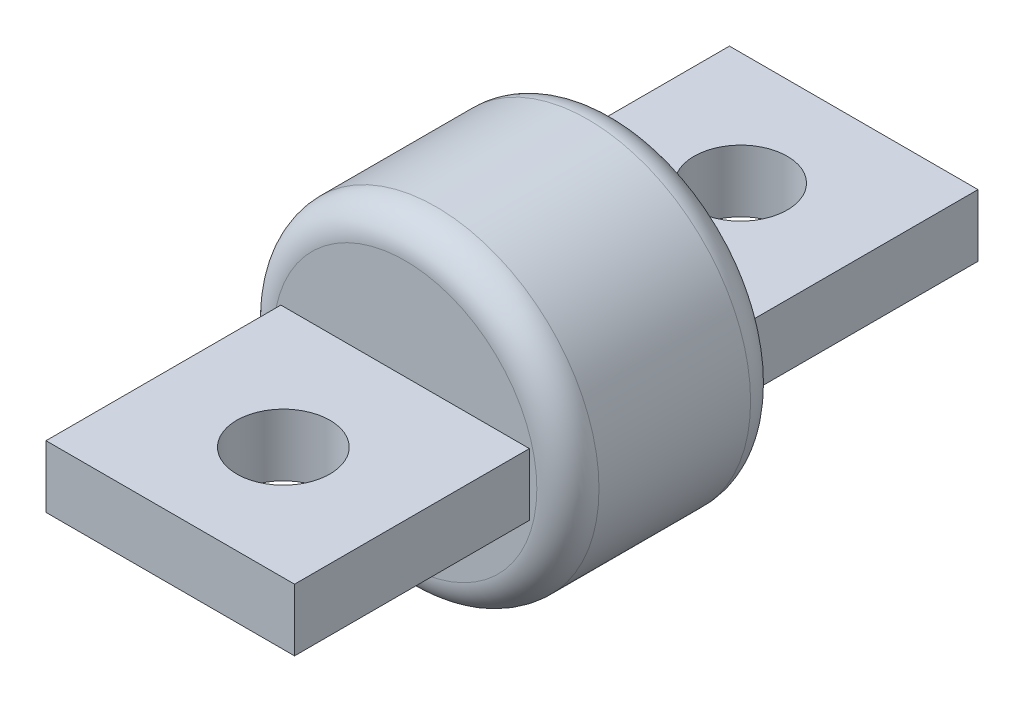
ISO-10303-21;
HEADER;
FILE_DESCRIPTION(('STEP AP214'),'2;1');
FILE_NAME('part.step','',(''),(''),'','','');
FILE_SCHEMA(('AUTOMOTIVE_DESIGN { 1 0 10303 214 1 1 1 1 }'));
ENDSEC;
DATA;
#1=APPLICATION_CONTEXT('core data for automotive mechanical design processes');
#2=APPLICATION_PROTOCOL_DEFINITION('international standard','automotive_design',2000,#1);
#3=PRODUCT_CONTEXT('',#1,'mechanical');
#4=PRODUCT('Part','Part','',(#3));
#5=PRODUCT_RELATED_PRODUCT_CATEGORY('part','',(#4));
#6=PRODUCT_DEFINITION_FORMATION('','',#4);
#7=PRODUCT_DEFINITION_CONTEXT('part definition',#1,'design');
#8=PRODUCT_DEFINITION('design','',#6,#7);
#9=PRODUCT_DEFINITION_SHAPE('','',#8);
#10=(LENGTH_UNIT() NAMED_UNIT(*) SI_UNIT(.MILLI.,.METRE.));
#11=(NAMED_UNIT(*) PLANE_ANGLE_UNIT() SI_UNIT($,.RADIAN.));
#12=(NAMED_UNIT(*) SI_UNIT($,.STERADIAN.) SOLID_ANGLE_UNIT());
#13=UNCERTAINTY_MEASURE_WITH_UNIT(LENGTH_MEASURE(1.E-05),#10,'distance_accuracy_value','');
#14=(GEOMETRIC_REPRESENTATION_CONTEXT(3) GLOBAL_UNCERTAINTY_ASSIGNED_CONTEXT((#13)) GLOBAL_UNIT_ASSIGNED_CONTEXT((#10,
#11,#12)) REPRESENTATION_CONTEXT('',''));
#15=CARTESIAN_POINT('',(0.,0.,0.));
#16=DIRECTION('',(0.,0.,1.));
#17=DIRECTION('',(1.,0.,0.));
#18=AXIS2_PLACEMENT_3D('',#15,#16,#17);
#19=CARTESIAN_POINT('',(0.,0.,0.));
#20=DIRECTION('',(0.,0.,1.));
#21=DIRECTION('',(1.,0.,0.));
#22=AXIS2_PLACEMENT_3D('',#19,#20,#21);
#23=PLANE('',#22);
#24=CARTESIAN_POINT('',(0.,0.,0.));
#25=DIRECTION('',(0.,0.,1.));
#26=DIRECTION('',(1.,0.,0.));
#27=AXIS2_PLACEMENT_3D('',#24,#25,#26);
#28=CIRCLE('',#27,13.462);
#29=CARTESIAN_POINT('',(13.462,0.,0.));
#30=VERTEX_POINT('',#29);
#31=EDGE_CURVE('E56',#30,#30,#28,.F.);
#32=ORIENTED_EDGE('',*,*,#31,.T.);
#33=EDGE_LOOP('',(#32));
#34=FACE_BOUND('',#33,.T.);
#35=DIRECTION('',(0.,-1.,0.));
#36=VECTOR('',#35,1.);
#37=CARTESIAN_POINT('',(12.7,-3.175,0.));
#38=LINE('',#37,#36);
#39=CARTESIAN_POINT('',(12.7,3.175,0.));
#40=VERTEX_POINT('',#39);
#41=CARTESIAN_POINT('',(12.7,-3.175,0.));
#42=VERTEX_POINT('',#41);
#43=EDGE_CURVE('E133',#40,#42,#38,.T.);
#44=ORIENTED_EDGE('',*,*,#43,.F.);
#45=DIRECTION('',(1.,0.,0.));
#46=VECTOR('',#45,1.);
#47=CARTESIAN_POINT('',(-12.7,3.175,0.));
#48=LINE('',#47,#46);
#49=CARTESIAN_POINT('',(-12.7,3.175,0.));
#50=VERTEX_POINT('',#49);
#51=EDGE_CURVE('E130',#50,#40,#48,.T.);
#52=ORIENTED_EDGE('',*,*,#51,.F.);
#53=DIRECTION('',(0.,1.,0.));
#54=VECTOR('',#53,1.);
#55=CARTESIAN_POINT('',(-12.7,-3.175,0.));
#56=LINE('',#55,#54);
#57=CARTESIAN_POINT('',(-12.7,-3.175,0.));
#58=VERTEX_POINT('',#57);
#59=EDGE_CURVE('E68',#58,#50,#56,.T.);
#60=ORIENTED_EDGE('',*,*,#59,.F.);
#61=DIRECTION('',(-1.,0.,0.));
#62=VECTOR('',#61,1.);
#63=CARTESIAN_POINT('',(-12.7,-3.175,0.));
#64=LINE('',#63,#62);
#65=EDGE_CURVE('E63',#42,#58,#64,.T.);
#66=ORIENTED_EDGE('',*,*,#65,.F.);
#67=EDGE_LOOP('',(#44,#52,#60,#66));
#68=FACE_BOUND('',#67,.T.);
#69=ADVANCED_FACE('F48',(#34,#68),#23,.F.);
#70=CARTESIAN_POINT('',(0.,0.,21.844));
#71=DIRECTION('',(0.,0.,1.));
#72=DIRECTION('',(1.,0.,0.));
#73=AXIS2_PLACEMENT_3D('',#70,#71,#72);
#74=PLANE('',#73);
#75=CARTESIAN_POINT('',(0.,0.,21.844));
#76=DIRECTION('',(0.,0.,1.));
#77=DIRECTION('',(1.,0.,0.));
#78=AXIS2_PLACEMENT_3D('',#75,#76,#77);
#79=CIRCLE('',#78,13.462);
#80=CARTESIAN_POINT('',(13.462,0.,21.844));
#81=VERTEX_POINT('',#80);
#82=EDGE_CURVE('E13',#81,#81,#79,.T.);
#83=ORIENTED_EDGE('',*,*,#82,.T.);
#84=EDGE_LOOP('',(#83));
#85=FACE_BOUND('',#84,.T.);
#86=DIRECTION('',(-1.,0.,0.));
#87=VECTOR('',#86,1.);
#88=CARTESIAN_POINT('',(-12.7,3.175,21.844));
#89=LINE('',#88,#87);
#90=CARTESIAN_POINT('',(12.7,3.175,21.844));
#91=VERTEX_POINT('',#90);
#92=CARTESIAN_POINT('',(-12.7,3.175,21.844));
#93=VERTEX_POINT('',#92);
#94=EDGE_CURVE('E137',#91,#93,#89,.T.);
#95=ORIENTED_EDGE('',*,*,#94,.F.);
#96=DIRECTION('',(0.,1.,0.));
#97=VECTOR('',#96,1.);
#98=CARTESIAN_POINT('',(12.7,-3.175,21.844));
#99=LINE('',#98,#97);
#100=CARTESIAN_POINT('',(12.7,-3.175,21.844));
#101=VERTEX_POINT('',#100);
#102=EDGE_CURVE('E134',#101,#91,#99,.T.);
#103=ORIENTED_EDGE('',*,*,#102,.F.);
#104=DIRECTION('',(1.,0.,0.));
#105=VECTOR('',#104,1.);
#106=CARTESIAN_POINT('',(-12.7,-3.175,21.844));
#107=LINE('',#106,#105);
#108=CARTESIAN_POINT('',(-12.7,-3.175,21.844));
#109=VERTEX_POINT('',#108);
#110=EDGE_CURVE('E147',#109,#101,#107,.T.);
#111=ORIENTED_EDGE('',*,*,#110,.F.);
#112=DIRECTION('',(0.,-1.,0.));
#113=VECTOR('',#112,1.);
#114=CARTESIAN_POINT('',(-12.7,-3.175,21.844));
#115=LINE('',#114,#113);
#116=EDGE_CURVE('E155',#93,#109,#115,.T.);
#117=ORIENTED_EDGE('',*,*,#116,.F.);
#118=EDGE_LOOP('',(#95,#103,#111,#117));
#119=FACE_BOUND('',#118,.T.);
#120=ADVANCED_FACE('F192',(#85,#119),#74,.T.);
#121=CARTESIAN_POINT('',(0.,0.,21.844));
#122=DIRECTION('',(0.,0.,-1.));
#123=DIRECTION('',(-1.,0.,0.));
#124=AXIS2_PLACEMENT_3D('',#121,#122,#123);
#125=CYLINDRICAL_SURFACE('',#124,16.637);
#126=CARTESIAN_POINT('',(0.,0.,3.175));
#127=DIRECTION('',(0.,0.,1.));
#128=DIRECTION('',(1.,0.,0.));
#129=AXIS2_PLACEMENT_3D('',#126,#127,#128);
#130=CIRCLE('',#129,16.637);
#131=CARTESIAN_POINT('',(16.637,0.,3.175));
#132=VERTEX_POINT('',#131);
#133=EDGE_CURVE('E176',#132,#132,#130,.T.);
#134=ORIENTED_EDGE('',*,*,#133,.T.);
#135=EDGE_LOOP('',(#134));
#136=FACE_BOUND('',#135,.T.);
#137=CARTESIAN_POINT('',(0.,0.,18.669));
#138=DIRECTION('',(0.,0.,1.));
#139=DIRECTION('',(1.,0.,0.));
#140=AXIS2_PLACEMENT_3D('',#137,#138,#139);
#141=CIRCLE('',#140,16.637);
#142=CARTESIAN_POINT('',(16.637,0.,18.669));
#143=VERTEX_POINT('',#142);
#144=EDGE_CURVE('E168',#143,#143,#141,.F.);
#145=ORIENTED_EDGE('',*,*,#144,.T.);
#146=EDGE_LOOP('',(#145));
#147=FACE_BOUND('',#146,.T.);
#148=ADVANCED_FACE('F188',(#136,#147),#125,.T.);
#149=CARTESIAN_POINT('',(12.7,-3.175,45.847));
#150=DIRECTION('',(-1.,0.,0.));
#151=DIRECTION('',(0.,0.,1.));
#152=AXIS2_PLACEMENT_3D('',#149,#150,#151);
#153=PLANE('',#152);
#154=ORIENTED_EDGE('',*,*,#102,.T.);
#155=DIRECTION('',(0.,0.,-1.));
#156=VECTOR('',#155,1.);
#157=CARTESIAN_POINT('',(12.7,3.175,45.847));
#158=LINE('',#157,#156);
#159=CARTESIAN_POINT('',(12.7,3.175,45.847));
#160=VERTEX_POINT('',#159);
#161=EDGE_CURVE('E166',#160,#91,#158,.T.);
#162=ORIENTED_EDGE('',*,*,#161,.F.);
#163=DIRECTION('',(0.,1.,0.));
#164=VECTOR('',#163,1.);
#165=CARTESIAN_POINT('',(12.7,-3.175,45.847));
#166=LINE('',#165,#164);
#167=CARTESIAN_POINT('',(12.7,-3.175,45.847));
#168=VERTEX_POINT('',#167);
#169=EDGE_CURVE('E143',#168,#160,#166,.T.);
#170=ORIENTED_EDGE('',*,*,#169,.F.);
#171=DIRECTION('',(0.,0.,-1.));
#172=VECTOR('',#171,1.);
#173=CARTESIAN_POINT('',(12.7,-3.175,45.847));
#174=LINE('',#173,#172);
#175=EDGE_CURVE('E152',#168,#101,#174,.T.);
#176=ORIENTED_EDGE('',*,*,#175,.T.);
#177=EDGE_LOOP('',(#154,#162,#170,#176));
#178=FACE_BOUND('',#177,.T.);
#179=ADVANCED_FACE('F191',(#178),#153,.F.);
#180=CARTESIAN_POINT('',(-12.7,3.175,45.847));
#181=DIRECTION('',(0.,-1.,0.));
#182=DIRECTION('',(0.,0.,-1.));
#183=AXIS2_PLACEMENT_3D('',#180,#181,#182);
#184=PLANE('',#183);
#185=CARTESIAN_POINT('',(0.,3.175,34.29));
#186=DIRECTION('',(0.,1.,0.));
#187=DIRECTION('',(-1.,0.,0.));
#188=AXIS2_PLACEMENT_3D('',#185,#186,#187);
#189=CIRCLE('',#188,4.7625);
#190=CARTESIAN_POINT('',(-4.7625,3.175,34.29));
#191=VERTEX_POINT('',#190);
#192=EDGE_CURVE('E173',#191,#191,#189,.T.);
#193=ORIENTED_EDGE('',*,*,#192,.F.);
#194=EDGE_LOOP('',(#193));
#195=FACE_BOUND('',#194,.T.);
#196=ORIENTED_EDGE('',*,*,#94,.T.);
#197=DIRECTION('',(0.,0.,-1.));
#198=VECTOR('',#197,1.);
#199=CARTESIAN_POINT('',(-12.7,3.175,45.847));
#200=LINE('',#199,#198);
#201=CARTESIAN_POINT('',(-12.7,3.175,45.847));
#202=VERTEX_POINT('',#201);
#203=EDGE_CURVE('E163',#202,#93,#200,.T.);
#204=ORIENTED_EDGE('',*,*,#203,.F.);
#205=DIRECTION('',(-1.,0.,0.));
#206=VECTOR('',#205,1.);
#207=CARTESIAN_POINT('',(-12.7,3.175,45.847));
#208=LINE('',#207,#206);
#209=EDGE_CURVE('E146',#160,#202,#208,.T.);
#210=ORIENTED_EDGE('',*,*,#209,.F.);
#211=ORIENTED_EDGE('',*,*,#161,.T.);
#212=EDGE_LOOP('',(#196,#204,#210,#211));
#213=FACE_BOUND('',#212,.T.);
#214=ADVANCED_FACE('F209',(#195,#213),#184,.F.);
#215=CARTESIAN_POINT('',(-12.7,-3.175,45.847));
#216=DIRECTION('',(1.,0.,0.));
#217=DIRECTION('',(0.,0.,-1.));
#218=AXIS2_PLACEMENT_3D('',#215,#216,#217);
#219=PLANE('',#218);
#220=ORIENTED_EDGE('',*,*,#116,.T.);
#221=DIRECTION('',(0.,0.,-1.));
#222=VECTOR('',#221,1.);
#223=CARTESIAN_POINT('',(-12.7,-3.175,45.847));
#224=LINE('',#223,#222);
#225=CARTESIAN_POINT('',(-12.7,-3.175,45.847));
#226=VERTEX_POINT('',#225);
#227=EDGE_CURVE('E161',#226,#109,#224,.T.);
#228=ORIENTED_EDGE('',*,*,#227,.F.);
#229=DIRECTION('',(0.,-1.,0.));
#230=VECTOR('',#229,1.);
#231=CARTESIAN_POINT('',(-12.7,-3.175,45.847));
#232=LINE('',#231,#230);
#233=EDGE_CURVE('E149',#202,#226,#232,.T.);
#234=ORIENTED_EDGE('',*,*,#233,.F.);
#235=ORIENTED_EDGE('',*,*,#203,.T.);
#236=EDGE_LOOP('',(#220,#228,#234,#235));
#237=FACE_BOUND('',#236,.T.);
#238=ADVANCED_FACE('F213',(#237),#219,.F.);
#239=CARTESIAN_POINT('',(-12.7,-3.175,45.847));
#240=DIRECTION('',(0.,1.,0.));
#241=DIRECTION('',(0.,0.,1.));
#242=AXIS2_PLACEMENT_3D('',#239,#240,#241);
#243=PLANE('',#242);
#244=CARTESIAN_POINT('',(0.,-3.175,34.29));
#245=DIRECTION('',(0.,1.,0.));
#246=DIRECTION('',(0.,0.,1.));
#247=AXIS2_PLACEMENT_3D('',#244,#245,#246);
#248=CIRCLE('',#247,4.7625);
#249=CARTESIAN_POINT('',(0.,-3.175,39.0525));
#250=VERTEX_POINT('',#249);
#251=EDGE_CURVE('E169',#250,#250,#248,.T.);
#252=ORIENTED_EDGE('',*,*,#251,.T.);
#253=EDGE_LOOP('',(#252));
#254=FACE_BOUND('',#253,.T.);
#255=ORIENTED_EDGE('',*,*,#110,.T.);
#256=ORIENTED_EDGE('',*,*,#175,.F.);
#257=DIRECTION('',(1.,0.,0.));
#258=VECTOR('',#257,1.);
#259=CARTESIAN_POINT('',(-12.7,-3.175,45.847));
#260=LINE('',#259,#258);
#261=EDGE_CURVE('E151',#226,#168,#260,.T.);
#262=ORIENTED_EDGE('',*,*,#261,.F.);
#263=ORIENTED_EDGE('',*,*,#227,.T.);
#264=EDGE_LOOP('',(#255,#256,#262,#263));
#265=FACE_BOUND('',#264,.T.);
#266=ADVANCED_FACE('F222',(#254,#265),#243,.F.);
#267=CARTESIAN_POINT('',(0.,0.,45.847));
#268=DIRECTION('',(0.,0.,-1.));
#269=DIRECTION('',(-1.,0.,0.));
#270=AXIS2_PLACEMENT_3D('',#267,#268,#269);
#271=PLANE('',#270);
#272=ORIENTED_EDGE('',*,*,#169,.T.);
#273=ORIENTED_EDGE('',*,*,#209,.T.);
#274=ORIENTED_EDGE('',*,*,#233,.T.);
#275=ORIENTED_EDGE('',*,*,#261,.T.);
#276=EDGE_LOOP('',(#272,#273,#274,#275));
#277=FACE_BOUND('',#276,.T.);
#278=ADVANCED_FACE('F217',(#277),#271,.F.);
#279=CARTESIAN_POINT('',(12.7,-3.175,-24.003));
#280=DIRECTION('',(-1.,0.,0.));
#281=DIRECTION('',(0.,0.,1.));
#282=AXIS2_PLACEMENT_3D('',#279,#280,#281);
#283=PLANE('',#282);
#284=ORIENTED_EDGE('',*,*,#43,.T.);
#285=DIRECTION('',(0.,0.,1.));
#286=VECTOR('',#285,1.);
#287=CARTESIAN_POINT('',(12.7,-3.175,-24.003));
#288=LINE('',#287,#286);
#289=CARTESIAN_POINT('',(12.7,-3.175,-24.003));
#290=VERTEX_POINT('',#289);
#291=EDGE_CURVE('E114',#290,#42,#288,.T.);
#292=ORIENTED_EDGE('',*,*,#291,.F.);
#293=DIRECTION('',(0.,-1.,0.));
#294=VECTOR('',#293,1.);
#295=CARTESIAN_POINT('',(12.7,-3.175,-24.003));
#296=LINE('',#295,#294);
#297=CARTESIAN_POINT('',(12.7,3.175,-24.003));
#298=VERTEX_POINT('',#297);
#299=EDGE_CURVE('E121',#298,#290,#296,.T.);
#300=ORIENTED_EDGE('',*,*,#299,.F.);
#301=DIRECTION('',(0.,0.,1.));
#302=VECTOR('',#301,1.);
#303=CARTESIAN_POINT('',(12.7,3.175,-24.003));
#304=LINE('',#303,#302);
#305=EDGE_CURVE('E255',#298,#40,#304,.T.);
#306=ORIENTED_EDGE('',*,*,#305,.T.);
#307=EDGE_LOOP('',(#284,#292,#300,#306));
#308=FACE_BOUND('',#307,.T.);
#309=ADVANCED_FACE('F132',(#308),#283,.F.);
#310=CARTESIAN_POINT('',(-12.7,-3.175,-24.003));
#311=DIRECTION('',(0.,1.,0.));
#312=DIRECTION('',(-1.,0.,0.));
#313=AXIS2_PLACEMENT_3D('',#310,#311,#312);
#314=PLANE('',#313);
#315=CARTESIAN_POINT('',(0.,-3.175,-12.446));
#316=DIRECTION('',(0.,1.,0.));
#317=DIRECTION('',(-1.,0.,0.));
#318=AXIS2_PLACEMENT_3D('',#315,#316,#317);
#319=CIRCLE('',#318,4.7625);
#320=CARTESIAN_POINT('',(-4.7625,-3.175,-12.446));
#321=VERTEX_POINT('',#320);
#322=EDGE_CURVE('E250',#321,#321,#319,.T.);
#323=ORIENTED_EDGE('',*,*,#322,.T.);
#324=EDGE_LOOP('',(#323));
#325=FACE_BOUND('',#324,.T.);
#326=ORIENTED_EDGE('',*,*,#65,.T.);
#327=DIRECTION('',(0.,0.,1.));
#328=VECTOR('',#327,1.);
#329=CARTESIAN_POINT('',(-12.7,-3.175,-24.003));
#330=LINE('',#329,#328);
#331=CARTESIAN_POINT('',(-12.7,-3.175,-24.003));
#332=VERTEX_POINT('',#331);
#333=EDGE_CURVE('E117',#332,#58,#330,.T.);
#334=ORIENTED_EDGE('',*,*,#333,.F.);
#335=DIRECTION('',(-1.,0.,0.));
#336=VECTOR('',#335,1.);
#337=CARTESIAN_POINT('',(-12.7,-3.175,-24.003));
#338=LINE('',#337,#336);
#339=EDGE_CURVE('E110',#290,#332,#338,.T.);
#340=ORIENTED_EDGE('',*,*,#339,.F.);
#341=ORIENTED_EDGE('',*,*,#291,.T.);
#342=EDGE_LOOP('',(#326,#334,#340,#341));
#343=FACE_BOUND('',#342,.T.);
#344=ADVANCED_FACE('F112',(#325,#343),#314,.F.);
#345=CARTESIAN_POINT('',(-12.7,-3.175,-24.003));
#346=DIRECTION('',(1.,0.,0.));
#347=DIRECTION('',(0.,0.,-1.));
#348=AXIS2_PLACEMENT_3D('',#345,#346,#347);
#349=PLANE('',#348);
#350=ORIENTED_EDGE('',*,*,#59,.T.);
#351=DIRECTION('',(0.,0.,1.));
#352=VECTOR('',#351,1.);
#353=CARTESIAN_POINT('',(-12.7,3.175,-24.003));
#354=LINE('',#353,#352);
#355=CARTESIAN_POINT('',(-12.7,3.175,-24.003));
#356=VERTEX_POINT('',#355);
#357=EDGE_CURVE('E139',#356,#50,#354,.T.);
#358=ORIENTED_EDGE('',*,*,#357,.F.);
#359=DIRECTION('',(0.,1.,0.));
#360=VECTOR('',#359,1.);
#361=CARTESIAN_POINT('',(-12.7,-3.175,-24.003));
#362=LINE('',#361,#360);
#363=EDGE_CURVE('E120',#332,#356,#362,.T.);
#364=ORIENTED_EDGE('',*,*,#363,.F.);
#365=ORIENTED_EDGE('',*,*,#333,.T.);
#366=EDGE_LOOP('',(#350,#358,#364,#365));
#367=FACE_BOUND('',#366,.T.);
#368=ADVANCED_FACE('F266',(#367),#349,.F.);
#369=CARTESIAN_POINT('',(-12.7,3.175,-24.003));
#370=DIRECTION('',(0.,-1.,0.));
#371=DIRECTION('',(1.,0.,0.));
#372=AXIS2_PLACEMENT_3D('',#369,#370,#371);
#373=PLANE('',#372);
#374=CARTESIAN_POINT('',(0.,3.175,-12.446));
#375=DIRECTION('',(0.,1.,0.));
#376=DIRECTION('',(-1.,0.,0.));
#377=AXIS2_PLACEMENT_3D('',#374,#375,#376);
#378=CIRCLE('',#377,4.7625);
#379=CARTESIAN_POINT('',(-4.7625,3.175,-12.446));
#380=VERTEX_POINT('',#379);
#381=EDGE_CURVE('E172',#380,#380,#378,.T.);
#382=ORIENTED_EDGE('',*,*,#381,.F.);
#383=EDGE_LOOP('',(#382));
#384=FACE_BOUND('',#383,.T.);
#385=ORIENTED_EDGE('',*,*,#51,.T.);
#386=ORIENTED_EDGE('',*,*,#305,.F.);
#387=DIRECTION('',(1.,0.,0.));
#388=VECTOR('',#387,1.);
#389=CARTESIAN_POINT('',(-12.7,3.175,-24.003));
#390=LINE('',#389,#388);
#391=EDGE_CURVE('E126',#356,#298,#390,.T.);
#392=ORIENTED_EDGE('',*,*,#391,.F.);
#393=ORIENTED_EDGE('',*,*,#357,.T.);
#394=EDGE_LOOP('',(#385,#386,#392,#393));
#395=FACE_BOUND('',#394,.T.);
#396=ADVANCED_FACE('F264',(#384,#395),#373,.F.);
#397=CARTESIAN_POINT('',(0.,0.,-24.003));
#398=DIRECTION('',(0.,0.,-1.));
#399=DIRECTION('',(-1.,0.,0.));
#400=AXIS2_PLACEMENT_3D('',#397,#398,#399);
#401=PLANE('',#400);
#402=ORIENTED_EDGE('',*,*,#299,.T.);
#403=ORIENTED_EDGE('',*,*,#339,.T.);
#404=ORIENTED_EDGE('',*,*,#363,.T.);
#405=ORIENTED_EDGE('',*,*,#391,.T.);
#406=EDGE_LOOP('',(#402,#403,#404,#405));
#407=FACE_BOUND('',#406,.T.);
#408=ADVANCED_FACE('F124',(#407),#401,.T.);
#409=CARTESIAN_POINT('',(0.,-16.637,-12.446));
#410=DIRECTION('',(0.,1.,0.));
#411=DIRECTION('',(-1.,0.,0.));
#412=AXIS2_PLACEMENT_3D('',#409,#410,#411);
#413=CYLINDRICAL_SURFACE('',#412,4.7625);
#414=ORIENTED_EDGE('',*,*,#381,.T.);
#415=EDGE_LOOP('',(#414));
#416=FACE_BOUND('',#415,.T.);
#417=ORIENTED_EDGE('',*,*,#322,.F.);
#418=EDGE_LOOP('',(#417));
#419=FACE_BOUND('',#418,.T.);
#420=ADVANCED_FACE('F299',(#416,#419),#413,.F.);
#421=CARTESIAN_POINT('',(0.,-16.637,34.29));
#422=DIRECTION('',(0.,1.,0.));
#423=DIRECTION('',(-1.,0.,0.));
#424=AXIS2_PLACEMENT_3D('',#421,#422,#423);
#425=CYLINDRICAL_SURFACE('',#424,4.7625);
#426=ORIENTED_EDGE('',*,*,#192,.T.);
#427=EDGE_LOOP('',(#426));
#428=FACE_BOUND('',#427,.T.);
#429=ORIENTED_EDGE('',*,*,#251,.F.);
#430=EDGE_LOOP('',(#429));
#431=FACE_BOUND('',#430,.T.);
#432=ADVANCED_FACE('F185',(#428,#431),#425,.F.);
#433=CARTESIAN_POINT('',(0.,0.,3.175));
#434=DIRECTION('',(0.,0.,1.));
#435=DIRECTION('',(1.,0.,0.));
#436=AXIS2_PLACEMENT_3D('',#433,#434,#435);
#437=TOROIDAL_SURFACE('',#436,13.462,3.175);
#438=ORIENTED_EDGE('',*,*,#31,.F.);
#439=EDGE_LOOP('',(#438));
#440=FACE_BOUND('',#439,.T.);
#441=ORIENTED_EDGE('',*,*,#133,.F.);
#442=EDGE_LOOP('',(#441));
#443=FACE_BOUND('',#442,.T.);
#444=ADVANCED_FACE('F182',(#440,#443),#437,.T.);
#445=CARTESIAN_POINT('',(0.,0.,18.669));
#446=DIRECTION('',(0.,0.,1.));
#447=DIRECTION('',(1.,0.,0.));
#448=AXIS2_PLACEMENT_3D('',#445,#446,#447);
#449=TOROIDAL_SURFACE('',#448,13.462,3.175);
#450=ORIENTED_EDGE('',*,*,#144,.F.);
#451=EDGE_LOOP('',(#450));
#452=FACE_BOUND('',#451,.T.);
#453=ORIENTED_EDGE('',*,*,#82,.F.);
#454=EDGE_LOOP('',(#453));
#455=FACE_BOUND('',#454,.T.);
#456=ADVANCED_FACE('F50',(#452,#455),#449,.T.);
#457=CLOSED_SHELL('',(#69,#120,#148,#179,#214,#238,#266,#278,#309,#344,#368,#396,#408,#420,#432,
#444,#456));
#458=MANIFOLD_SOLID_BREP('B2',#457);
#459=ADVANCED_BREP_SHAPE_REPRESENTATION('',(#18,#458),#14);
#460=SHAPE_DEFINITION_REPRESENTATION(#9,#459);
ENDSEC;
END-ISO-10303-21;
